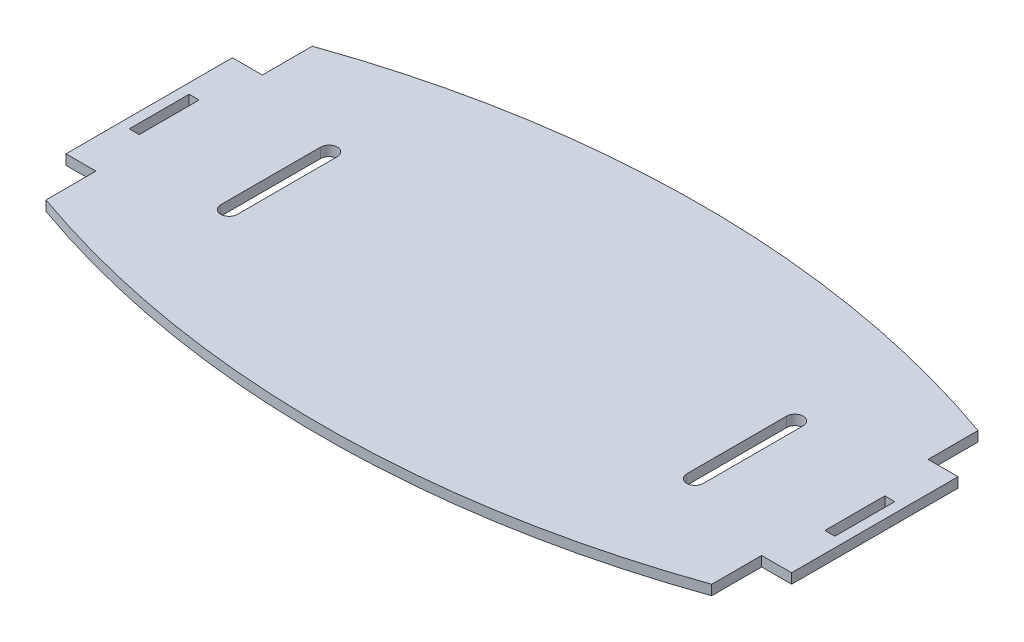
ISO-10303-21;
HEADER;
FILE_DESCRIPTION(('STEP AP214'),'2;1');
FILE_NAME('part.step','',(''),(''),'','','');
FILE_SCHEMA(('AUTOMOTIVE_DESIGN { 1 0 10303 214 1 1 1 1 }'));
ENDSEC;
DATA;
#1=APPLICATION_CONTEXT('core data for automotive mechanical design processes');
#2=APPLICATION_PROTOCOL_DEFINITION('international standard','automotive_design',2000,#1);
#3=PRODUCT_CONTEXT('',#1,'mechanical');
#4=PRODUCT('Part','Part','',(#3));
#5=PRODUCT_RELATED_PRODUCT_CATEGORY('part','',(#4));
#6=PRODUCT_DEFINITION_FORMATION('','',#4);
#7=PRODUCT_DEFINITION_CONTEXT('part definition',#1,'design');
#8=PRODUCT_DEFINITION('design','',#6,#7);
#9=PRODUCT_DEFINITION_SHAPE('','',#8);
#10=(LENGTH_UNIT() NAMED_UNIT(*) SI_UNIT(.MILLI.,.METRE.));
#11=(NAMED_UNIT(*) PLANE_ANGLE_UNIT() SI_UNIT($,.RADIAN.));
#12=(NAMED_UNIT(*) SI_UNIT($,.STERADIAN.) SOLID_ANGLE_UNIT());
#13=UNCERTAINTY_MEASURE_WITH_UNIT(LENGTH_MEASURE(1.E-05),#10,'distance_accuracy_value','');
#14=(GEOMETRIC_REPRESENTATION_CONTEXT(3) GLOBAL_UNCERTAINTY_ASSIGNED_CONTEXT((#13)) GLOBAL_UNIT_ASSIGNED_CONTEXT((#10,
#11,#12)) REPRESENTATION_CONTEXT('',''));
#15=CARTESIAN_POINT('',(0.,0.,0.));
#16=DIRECTION('',(0.,0.,1.));
#17=DIRECTION('',(1.,0.,0.));
#18=AXIS2_PLACEMENT_3D('',#15,#16,#17);
#19=CARTESIAN_POINT('',(0.,3.,-242.842712474619));
#20=DIRECTION('',(0.,1.,0.));
#21=DIRECTION('',(0.,0.,1.));
#22=AXIS2_PLACEMENT_3D('',#19,#20,#21);
#23=PLANE('',#22);
#24=CARTESIAN_POINT('',(0.,3.,-242.842712474619));
#25=DIRECTION('',(0.,1.,0.));
#26=DIRECTION('',(0.,0.,1.));
#27=AXIS2_PLACEMENT_3D('',#24,#25,#26);
#28=CIRCLE('',#27,300.);
#29=CARTESIAN_POINT('',(-100.,3.,40.));
#30=VERTEX_POINT('',#29);
#31=CARTESIAN_POINT('',(99.9999999999999,3.,40.));
#32=VERTEX_POINT('',#31);
#33=EDGE_CURVE('E346',#30,#32,#28,.T.);
#34=ORIENTED_EDGE('',*,*,#33,.T.);
#35=DIRECTION('',(0.,0.,-1.));
#36=VECTOR('',#35,1.);
#37=CARTESIAN_POINT('',(99.9999999999999,3.,40.));
#38=LINE('',#37,#36);
#39=CARTESIAN_POINT('',(100.,3.,25.));
#40=VERTEX_POINT('',#39);
#41=EDGE_CURVE('E349',#32,#40,#38,.T.);
#42=ORIENTED_EDGE('',*,*,#41,.T.);
#43=DIRECTION('',(1.,0.,0.));
#44=VECTOR('',#43,1.);
#45=CARTESIAN_POINT('',(100.,3.,25.));
#46=LINE('',#45,#44);
#47=CARTESIAN_POINT('',(109.,3.,25.));
#48=VERTEX_POINT('',#47);
#49=EDGE_CURVE('E352',#40,#48,#46,.T.);
#50=ORIENTED_EDGE('',*,*,#49,.T.);
#51=DIRECTION('',(0.,0.,-1.));
#52=VECTOR('',#51,1.);
#53=CARTESIAN_POINT('',(109.,3.,-25.));
#54=LINE('',#53,#52);
#55=CARTESIAN_POINT('',(109.,3.,-25.));
#56=VERTEX_POINT('',#55);
#57=EDGE_CURVE('E354',#48,#56,#54,.T.);
#58=ORIENTED_EDGE('',*,*,#57,.T.);
#59=DIRECTION('',(-1.,0.,0.));
#60=VECTOR('',#59,1.);
#61=CARTESIAN_POINT('',(100.,3.,-25.));
#62=LINE('',#61,#60);
#63=CARTESIAN_POINT('',(100.,3.,-25.));
#64=VERTEX_POINT('',#63);
#65=EDGE_CURVE('E356',#56,#64,#62,.T.);
#66=ORIENTED_EDGE('',*,*,#65,.T.);
#67=DIRECTION('',(0.,0.,-1.));
#68=VECTOR('',#67,1.);
#69=CARTESIAN_POINT('',(99.9999999999999,3.,-40.));
#70=LINE('',#69,#68);
#71=CARTESIAN_POINT('',(99.9999999999999,3.,-40.));
#72=VERTEX_POINT('',#71);
#73=EDGE_CURVE('E358',#64,#72,#70,.T.);
#74=ORIENTED_EDGE('',*,*,#73,.T.);
#75=CARTESIAN_POINT('',(0.,3.,242.842712474619));
#76=DIRECTION('',(0.,1.,0.));
#77=DIRECTION('',(0.,0.,-1.));
#78=AXIS2_PLACEMENT_3D('',#75,#76,#77);
#79=CIRCLE('',#78,300.);
#80=CARTESIAN_POINT('',(-100.,3.,-39.9999999999999));
#81=VERTEX_POINT('',#80);
#82=EDGE_CURVE('E360',#72,#81,#79,.T.);
#83=ORIENTED_EDGE('',*,*,#82,.T.);
#84=DIRECTION('',(0.,0.,1.));
#85=VECTOR('',#84,1.);
#86=CARTESIAN_POINT('',(-100.,3.,-40.));
#87=LINE('',#86,#85);
#88=CARTESIAN_POINT('',(-100.,3.,-25.));
#89=VERTEX_POINT('',#88);
#90=EDGE_CURVE('E362',#81,#89,#87,.T.);
#91=ORIENTED_EDGE('',*,*,#90,.T.);
#92=DIRECTION('',(-1.,0.,0.));
#93=VECTOR('',#92,1.);
#94=CARTESIAN_POINT('',(-100.,3.,-25.));
#95=LINE('',#94,#93);
#96=CARTESIAN_POINT('',(-109.,3.,-25.));
#97=VERTEX_POINT('',#96);
#98=EDGE_CURVE('E364',#89,#97,#95,.T.);
#99=ORIENTED_EDGE('',*,*,#98,.T.);
#100=DIRECTION('',(0.,0.,1.));
#101=VECTOR('',#100,1.);
#102=CARTESIAN_POINT('',(-109.,3.,-25.));
#103=LINE('',#102,#101);
#104=CARTESIAN_POINT('',(-109.,3.,25.));
#105=VERTEX_POINT('',#104);
#106=EDGE_CURVE('E366',#97,#105,#103,.T.);
#107=ORIENTED_EDGE('',*,*,#106,.T.);
#108=DIRECTION('',(1.,0.,0.));
#109=VECTOR('',#108,1.);
#110=CARTESIAN_POINT('',(-100.,3.,25.));
#111=LINE('',#110,#109);
#112=CARTESIAN_POINT('',(-100.,3.,25.));
#113=VERTEX_POINT('',#112);
#114=EDGE_CURVE('E368',#105,#113,#111,.T.);
#115=ORIENTED_EDGE('',*,*,#114,.T.);
#116=DIRECTION('',(0.,0.,1.));
#117=VECTOR('',#116,1.);
#118=CARTESIAN_POINT('',(-100.,3.,40.));
#119=LINE('',#118,#117);
#120=EDGE_CURVE('E370',#113,#30,#119,.T.);
#121=ORIENTED_EDGE('',*,*,#120,.T.);
#122=EDGE_LOOP('',(#34,#42,#50,#58,#66,#74,#83,#91,#99,#107,#115,#121));
#123=FACE_BOUND('',#122,.T.);
#124=DIRECTION('',(0.,0.,-1.));
#125=VECTOR('',#124,1.);
#126=CARTESIAN_POINT('',(106.,3.,-9.));
#127=LINE('',#126,#125);
#128=CARTESIAN_POINT('',(106.,3.,9.));
#129=VERTEX_POINT('',#128);
#130=CARTESIAN_POINT('',(106.,3.,-9.));
#131=VERTEX_POINT('',#130);
#132=EDGE_CURVE('E317',#129,#131,#127,.T.);
#133=ORIENTED_EDGE('',*,*,#132,.F.);
#134=DIRECTION('',(1.,0.,0.));
#135=VECTOR('',#134,1.);
#136=CARTESIAN_POINT('',(103.,3.,9.));
#137=LINE('',#136,#135);
#138=CARTESIAN_POINT('',(103.,3.,9.));
#139=VERTEX_POINT('',#138);
#140=EDGE_CURVE('E315',#139,#129,#137,.T.);
#141=ORIENTED_EDGE('',*,*,#140,.F.);
#142=DIRECTION('',(0.,0.,1.));
#143=VECTOR('',#142,1.);
#144=CARTESIAN_POINT('',(103.,3.,9.));
#145=LINE('',#144,#143);
#146=CARTESIAN_POINT('',(103.,3.,-9.00000000000001));
#147=VERTEX_POINT('',#146);
#148=EDGE_CURVE('E323',#147,#139,#145,.T.);
#149=ORIENTED_EDGE('',*,*,#148,.F.);
#150=DIRECTION('',(-1.,0.,0.));
#151=VECTOR('',#150,1.);
#152=CARTESIAN_POINT('',(103.,3.,-9.));
#153=LINE('',#152,#151);
#154=EDGE_CURVE('E320',#131,#147,#153,.T.);
#155=ORIENTED_EDGE('',*,*,#154,.F.);
#156=EDGE_LOOP('',(#133,#141,#149,#155));
#157=FACE_BOUND('',#156,.T.);
#158=DIRECTION('',(-1.,0.,0.));
#159=VECTOR('',#158,1.);
#160=CARTESIAN_POINT('',(-103.,3.,-9.));
#161=LINE('',#160,#159);
#162=CARTESIAN_POINT('',(-103.,3.,-9.));
#163=VERTEX_POINT('',#162);
#164=CARTESIAN_POINT('',(-106.,3.,-9.));
#165=VERTEX_POINT('',#164);
#166=EDGE_CURVE('E286',#163,#165,#161,.T.);
#167=ORIENTED_EDGE('',*,*,#166,.F.);
#168=DIRECTION('',(0.,0.,-1.));
#169=VECTOR('',#168,1.);
#170=CARTESIAN_POINT('',(-103.,3.,9.));
#171=LINE('',#170,#169);
#172=CARTESIAN_POINT('',(-103.,3.,9.));
#173=VERTEX_POINT('',#172);
#174=EDGE_CURVE('E284',#173,#163,#171,.T.);
#175=ORIENTED_EDGE('',*,*,#174,.F.);
#176=DIRECTION('',(1.,0.,0.));
#177=VECTOR('',#176,1.);
#178=CARTESIAN_POINT('',(-103.,3.,9.));
#179=LINE('',#178,#177);
#180=CARTESIAN_POINT('',(-106.,3.,8.99999999999998));
#181=VERTEX_POINT('',#180);
#182=EDGE_CURVE('E292',#181,#173,#179,.T.);
#183=ORIENTED_EDGE('',*,*,#182,.F.);
#184=DIRECTION('',(0.,0.,1.));
#185=VECTOR('',#184,1.);
#186=CARTESIAN_POINT('',(-106.,3.,-9.));
#187=LINE('',#186,#185);
#188=EDGE_CURVE('E289',#165,#181,#187,.T.);
#189=ORIENTED_EDGE('',*,*,#188,.F.);
#190=EDGE_LOOP('',(#167,#175,#183,#189));
#191=FACE_BOUND('',#190,.T.);
#192=DIRECTION('',(0.,0.,1.));
#193=VECTOR('',#192,1.);
#194=CARTESIAN_POINT('',(-72.5000000000001,3.,15.));
#195=LINE('',#194,#193);
#196=CARTESIAN_POINT('',(-72.5000000000001,3.,-15.));
#197=VERTEX_POINT('',#196);
#198=CARTESIAN_POINT('',(-72.5000000000001,3.,15.));
#199=VERTEX_POINT('',#198);
#200=EDGE_CURVE('E255',#197,#199,#195,.T.);
#201=ORIENTED_EDGE('',*,*,#200,.F.);
#202=CARTESIAN_POINT('',(-70.,3.,-15.));
#203=DIRECTION('',(0.,1.,0.));
#204=DIRECTION('',(0.,0.,-1.));
#205=AXIS2_PLACEMENT_3D('',#202,#203,#204);
#206=CIRCLE('',#205,2.5);
#207=CARTESIAN_POINT('',(-67.5000000000001,3.,-15.));
#208=VERTEX_POINT('',#207);
#209=EDGE_CURVE('E253',#208,#197,#206,.T.);
#210=ORIENTED_EDGE('',*,*,#209,.F.);
#211=DIRECTION('',(0.,0.,-1.));
#212=VECTOR('',#211,1.);
#213=CARTESIAN_POINT('',(-67.5000000000001,3.,-15.));
#214=LINE('',#213,#212);
#215=CARTESIAN_POINT('',(-67.5000000000001,3.,15.));
#216=VERTEX_POINT('',#215);
#217=EDGE_CURVE('E261',#216,#208,#214,.T.);
#218=ORIENTED_EDGE('',*,*,#217,.F.);
#219=CARTESIAN_POINT('',(-70.,3.,15.));
#220=DIRECTION('',(0.,1.,0.));
#221=DIRECTION('',(0.,0.,1.));
#222=AXIS2_PLACEMENT_3D('',#219,#220,#221);
#223=CIRCLE('',#222,2.5);
#224=EDGE_CURVE('E258',#199,#216,#223,.T.);
#225=ORIENTED_EDGE('',*,*,#224,.F.);
#226=EDGE_LOOP('',(#201,#210,#218,#225));
#227=FACE_BOUND('',#226,.T.);
#228=DIRECTION('',(0.,0.,-1.));
#229=VECTOR('',#228,1.);
#230=CARTESIAN_POINT('',(72.5000000000001,3.,15.));
#231=LINE('',#230,#229);
#232=CARTESIAN_POINT('',(72.5000000000001,3.,15.));
#233=VERTEX_POINT('',#232);
#234=CARTESIAN_POINT('',(72.5000000000001,3.,-15.));
#235=VERTEX_POINT('',#234);
#236=EDGE_CURVE('E225',#233,#235,#231,.T.);
#237=ORIENTED_EDGE('',*,*,#236,.F.);
#238=CARTESIAN_POINT('',(70.,3.,15.));
#239=DIRECTION('',(0.,1.,0.));
#240=DIRECTION('',(0.,0.,-1.));
#241=AXIS2_PLACEMENT_3D('',#238,#239,#240);
#242=CIRCLE('',#241,2.5);
#243=CARTESIAN_POINT('',(67.5000000000001,3.,15.));
#244=VERTEX_POINT('',#243);
#245=EDGE_CURVE('E217',#244,#233,#242,.T.);
#246=ORIENTED_EDGE('',*,*,#245,.F.);
#247=DIRECTION('',(0.,0.,1.));
#248=VECTOR('',#247,1.);
#249=CARTESIAN_POINT('',(67.5000000000001,3.,-15.));
#250=LINE('',#249,#248);
#251=CARTESIAN_POINT('',(67.5000000000001,3.,-15.));
#252=VERTEX_POINT('',#251);
#253=EDGE_CURVE('E239',#252,#244,#250,.T.);
#254=ORIENTED_EDGE('',*,*,#253,.F.);
#255=CARTESIAN_POINT('',(70.,3.,-15.));
#256=DIRECTION('',(0.,1.,0.));
#257=DIRECTION('',(0.,0.,1.));
#258=AXIS2_PLACEMENT_3D('',#255,#256,#257);
#259=CIRCLE('',#258,2.5);
#260=EDGE_CURVE('E237',#235,#252,#259,.T.);
#261=ORIENTED_EDGE('',*,*,#260,.F.);
#262=EDGE_LOOP('',(#237,#246,#254,#261));
#263=FACE_BOUND('',#262,.T.);
#264=ADVANCED_FACE('F32',(#123,#157,#191,#227,#263),#23,.T.);
#265=CARTESIAN_POINT('',(0.,0.,-242.842712474619));
#266=DIRECTION('',(0.,1.,0.));
#267=DIRECTION('',(0.,0.,1.));
#268=AXIS2_PLACEMENT_3D('',#265,#266,#267);
#269=PLANE('',#268);
#270=CARTESIAN_POINT('',(-70.,0.,-15.));
#271=DIRECTION('',(0.,1.,0.));
#272=DIRECTION('',(0.,0.,-1.));
#273=AXIS2_PLACEMENT_3D('',#270,#271,#272);
#274=CIRCLE('',#273,2.5);
#275=CARTESIAN_POINT('',(-67.5000000000001,0.,-15.));
#276=VERTEX_POINT('',#275);
#277=CARTESIAN_POINT('',(-72.5000000000001,0.,-15.));
#278=VERTEX_POINT('',#277);
#279=EDGE_CURVE('E233',#276,#278,#274,.T.);
#280=ORIENTED_EDGE('',*,*,#279,.T.);
#281=DIRECTION('',(0.,0.,1.));
#282=VECTOR('',#281,1.);
#283=CARTESIAN_POINT('',(-72.5000000000001,0.,15.));
#284=LINE('',#283,#282);
#285=CARTESIAN_POINT('',(-72.5000000000001,0.,15.));
#286=VERTEX_POINT('',#285);
#287=EDGE_CURVE('E266',#278,#286,#284,.T.);
#288=ORIENTED_EDGE('',*,*,#287,.T.);
#289=CARTESIAN_POINT('',(-70.,0.,15.));
#290=DIRECTION('',(0.,1.,0.));
#291=DIRECTION('',(0.,0.,1.));
#292=AXIS2_PLACEMENT_3D('',#289,#290,#291);
#293=CIRCLE('',#292,2.5);
#294=CARTESIAN_POINT('',(-67.5,0.,15.));
#295=VERTEX_POINT('',#294);
#296=EDGE_CURVE('E269',#286,#295,#293,.T.);
#297=ORIENTED_EDGE('',*,*,#296,.T.);
#298=DIRECTION('',(0.,0.,-1.));
#299=VECTOR('',#298,1.);
#300=CARTESIAN_POINT('',(-67.5000000000001,0.,-15.));
#301=LINE('',#300,#299);
#302=EDGE_CURVE('E256',#295,#276,#301,.T.);
#303=ORIENTED_EDGE('',*,*,#302,.T.);
#304=EDGE_LOOP('',(#280,#288,#297,#303));
#305=FACE_BOUND('',#304,.T.);
#306=DIRECTION('',(1.,0.,0.));
#307=VECTOR('',#306,1.);
#308=CARTESIAN_POINT('',(103.,0.,9.));
#309=LINE('',#308,#307);
#310=CARTESIAN_POINT('',(103.,0.,9.00000000000004));
#311=VERTEX_POINT('',#310);
#312=CARTESIAN_POINT('',(106.,0.,9.));
#313=VERTEX_POINT('',#312);
#314=EDGE_CURVE('E314',#311,#313,#309,.T.);
#315=ORIENTED_EDGE('',*,*,#314,.T.);
#316=DIRECTION('',(0.,0.,-1.));
#317=VECTOR('',#316,1.);
#318=CARTESIAN_POINT('',(106.,0.,-9.));
#319=LINE('',#318,#317);
#320=CARTESIAN_POINT('',(106.,0.,-9.));
#321=VERTEX_POINT('',#320);
#322=EDGE_CURVE('E328',#313,#321,#319,.T.);
#323=ORIENTED_EDGE('',*,*,#322,.T.);
#324=DIRECTION('',(-1.,0.,0.));
#325=VECTOR('',#324,1.);
#326=CARTESIAN_POINT('',(103.,0.,-9.));
#327=LINE('',#326,#325);
#328=CARTESIAN_POINT('',(103.,0.,-9.));
#329=VERTEX_POINT('',#328);
#330=EDGE_CURVE('E331',#321,#329,#327,.T.);
#331=ORIENTED_EDGE('',*,*,#330,.T.);
#332=DIRECTION('',(0.,0.,1.));
#333=VECTOR('',#332,1.);
#334=CARTESIAN_POINT('',(103.,0.,9.));
#335=LINE('',#334,#333);
#336=EDGE_CURVE('E318',#329,#311,#335,.T.);
#337=ORIENTED_EDGE('',*,*,#336,.T.);
#338=EDGE_LOOP('',(#315,#323,#331,#337));
#339=FACE_BOUND('',#338,.T.);
#340=CARTESIAN_POINT('',(0.,0.,-242.842712474619));
#341=DIRECTION('',(0.,1.,0.));
#342=DIRECTION('',(0.,0.,1.));
#343=AXIS2_PLACEMENT_3D('',#340,#341,#342);
#344=CIRCLE('',#343,300.);
#345=CARTESIAN_POINT('',(-100.,0.,40.));
#346=VERTEX_POINT('',#345);
#347=CARTESIAN_POINT('',(99.9999999999999,0.,40.));
#348=VERTEX_POINT('',#347);
#349=EDGE_CURVE('E345',#346,#348,#344,.T.);
#350=ORIENTED_EDGE('',*,*,#349,.F.);
#351=DIRECTION('',(0.,0.,1.));
#352=VECTOR('',#351,1.);
#353=CARTESIAN_POINT('',(-100.,0.,40.));
#354=LINE('',#353,#352);
#355=CARTESIAN_POINT('',(-100.,0.,25.));
#356=VERTEX_POINT('',#355);
#357=EDGE_CURVE('E350',#356,#346,#354,.T.);
#358=ORIENTED_EDGE('',*,*,#357,.F.);
#359=DIRECTION('',(1.,0.,0.));
#360=VECTOR('',#359,1.);
#361=CARTESIAN_POINT('',(-100.,0.,25.));
#362=LINE('',#361,#360);
#363=CARTESIAN_POINT('',(-109.,0.,25.));
#364=VERTEX_POINT('',#363);
#365=EDGE_CURVE('E393',#364,#356,#362,.T.);
#366=ORIENTED_EDGE('',*,*,#365,.F.);
#367=DIRECTION('',(0.,0.,1.));
#368=VECTOR('',#367,1.);
#369=CARTESIAN_POINT('',(-109.,0.,-25.));
#370=LINE('',#369,#368);
#371=CARTESIAN_POINT('',(-109.,0.,-25.));
#372=VERTEX_POINT('',#371);
#373=EDGE_CURVE('E391',#372,#364,#370,.T.);
#374=ORIENTED_EDGE('',*,*,#373,.F.);
#375=DIRECTION('',(-1.,0.,0.));
#376=VECTOR('',#375,1.);
#377=CARTESIAN_POINT('',(-100.,0.,-25.));
#378=LINE('',#377,#376);
#379=CARTESIAN_POINT('',(-100.,0.,-25.));
#380=VERTEX_POINT('',#379);
#381=EDGE_CURVE('E389',#380,#372,#378,.T.);
#382=ORIENTED_EDGE('',*,*,#381,.F.);
#383=DIRECTION('',(0.,0.,1.));
#384=VECTOR('',#383,1.);
#385=CARTESIAN_POINT('',(-100.,0.,-40.));
#386=LINE('',#385,#384);
#387=CARTESIAN_POINT('',(-100.,0.,-39.9999999999999));
#388=VERTEX_POINT('',#387);
#389=EDGE_CURVE('E387',#388,#380,#386,.T.);
#390=ORIENTED_EDGE('',*,*,#389,.F.);
#391=CARTESIAN_POINT('',(0.,0.,242.842712474619));
#392=DIRECTION('',(0.,1.,0.));
#393=DIRECTION('',(0.,0.,-1.));
#394=AXIS2_PLACEMENT_3D('',#391,#392,#393);
#395=CIRCLE('',#394,300.);
#396=CARTESIAN_POINT('',(99.9999999999999,0.,-40.));
#397=VERTEX_POINT('',#396);
#398=EDGE_CURVE('E385',#397,#388,#395,.T.);
#399=ORIENTED_EDGE('',*,*,#398,.F.);
#400=DIRECTION('',(0.,0.,-1.));
#401=VECTOR('',#400,1.);
#402=CARTESIAN_POINT('',(99.9999999999999,0.,-40.));
#403=LINE('',#402,#401);
#404=CARTESIAN_POINT('',(100.,0.,-25.));
#405=VERTEX_POINT('',#404);
#406=EDGE_CURVE('E383',#405,#397,#403,.T.);
#407=ORIENTED_EDGE('',*,*,#406,.F.);
#408=DIRECTION('',(-1.,0.,0.));
#409=VECTOR('',#408,1.);
#410=CARTESIAN_POINT('',(100.,0.,-25.));
#411=LINE('',#410,#409);
#412=CARTESIAN_POINT('',(109.,0.,-25.));
#413=VERTEX_POINT('',#412);
#414=EDGE_CURVE('E381',#413,#405,#411,.T.);
#415=ORIENTED_EDGE('',*,*,#414,.F.);
#416=DIRECTION('',(0.,0.,-1.));
#417=VECTOR('',#416,1.);
#418=CARTESIAN_POINT('',(109.,0.,-25.));
#419=LINE('',#418,#417);
#420=CARTESIAN_POINT('',(109.,0.,25.));
#421=VERTEX_POINT('',#420);
#422=EDGE_CURVE('E379',#421,#413,#419,.T.);
#423=ORIENTED_EDGE('',*,*,#422,.F.);
#424=DIRECTION('',(1.,0.,0.));
#425=VECTOR('',#424,1.);
#426=CARTESIAN_POINT('',(100.,0.,25.));
#427=LINE('',#426,#425);
#428=CARTESIAN_POINT('',(100.,0.,25.));
#429=VERTEX_POINT('',#428);
#430=EDGE_CURVE('E377',#429,#421,#427,.T.);
#431=ORIENTED_EDGE('',*,*,#430,.F.);
#432=DIRECTION('',(0.,0.,-1.));
#433=VECTOR('',#432,1.);
#434=CARTESIAN_POINT('',(99.9999999999999,0.,40.));
#435=LINE('',#434,#433);
#436=EDGE_CURVE('E375',#348,#429,#435,.T.);
#437=ORIENTED_EDGE('',*,*,#436,.F.);
#438=EDGE_LOOP('',(#350,#358,#366,#374,#382,#390,#399,#407,#415,#423,#431,#437));
#439=FACE_BOUND('',#438,.T.);
#440=DIRECTION('',(0.,0.,-1.));
#441=VECTOR('',#440,1.);
#442=CARTESIAN_POINT('',(-103.,0.,9.));
#443=LINE('',#442,#441);
#444=CARTESIAN_POINT('',(-103.,0.,8.99999999999998));
#445=VERTEX_POINT('',#444);
#446=CARTESIAN_POINT('',(-103.,0.,-9.));
#447=VERTEX_POINT('',#446);
#448=EDGE_CURVE('E283',#445,#447,#443,.T.);
#449=ORIENTED_EDGE('',*,*,#448,.T.);
#450=DIRECTION('',(-1.,0.,0.));
#451=VECTOR('',#450,1.);
#452=CARTESIAN_POINT('',(-103.,0.,-9.));
#453=LINE('',#452,#451);
#454=CARTESIAN_POINT('',(-106.,0.,-9.));
#455=VERTEX_POINT('',#454);
#456=EDGE_CURVE('E297',#447,#455,#453,.T.);
#457=ORIENTED_EDGE('',*,*,#456,.T.);
#458=DIRECTION('',(0.,0.,1.));
#459=VECTOR('',#458,1.);
#460=CARTESIAN_POINT('',(-106.,0.,-9.));
#461=LINE('',#460,#459);
#462=CARTESIAN_POINT('',(-106.,0.,9.));
#463=VERTEX_POINT('',#462);
#464=EDGE_CURVE('E300',#455,#463,#461,.T.);
#465=ORIENTED_EDGE('',*,*,#464,.T.);
#466=DIRECTION('',(1.,0.,0.));
#467=VECTOR('',#466,1.);
#468=CARTESIAN_POINT('',(-103.,0.,9.));
#469=LINE('',#468,#467);
#470=EDGE_CURVE('E287',#463,#445,#469,.T.);
#471=ORIENTED_EDGE('',*,*,#470,.T.);
#472=EDGE_LOOP('',(#449,#457,#465,#471));
#473=FACE_BOUND('',#472,.T.);
#474=CARTESIAN_POINT('',(70.,0.,15.));
#475=DIRECTION('',(0.,1.,0.));
#476=DIRECTION('',(0.,0.,-1.));
#477=AXIS2_PLACEMENT_3D('',#474,#475,#476);
#478=CIRCLE('',#477,2.5);
#479=CARTESIAN_POINT('',(67.5000000000001,0.,15.));
#480=VERTEX_POINT('',#479);
#481=CARTESIAN_POINT('',(72.5000000000001,0.,15.));
#482=VERTEX_POINT('',#481);
#483=EDGE_CURVE('E55',#480,#482,#478,.T.);
#484=ORIENTED_EDGE('',*,*,#483,.T.);
#485=DIRECTION('',(0.,0.,-1.));
#486=VECTOR('',#485,1.);
#487=CARTESIAN_POINT('',(72.5000000000001,0.,15.));
#488=LINE('',#487,#486);
#489=CARTESIAN_POINT('',(72.5000000000001,0.,-15.));
#490=VERTEX_POINT('',#489);
#491=EDGE_CURVE('E232',#482,#490,#488,.T.);
#492=ORIENTED_EDGE('',*,*,#491,.T.);
#493=CARTESIAN_POINT('',(70.,0.,-15.));
#494=DIRECTION('',(0.,1.,0.));
#495=DIRECTION('',(0.,0.,1.));
#496=AXIS2_PLACEMENT_3D('',#493,#494,#495);
#497=CIRCLE('',#496,2.5);
#498=CARTESIAN_POINT('',(67.4999999999999,0.,-15.));
#499=VERTEX_POINT('',#498);
#500=EDGE_CURVE('E245',#490,#499,#497,.T.);
#501=ORIENTED_EDGE('',*,*,#500,.T.);
#502=DIRECTION('',(0.,0.,1.));
#503=VECTOR('',#502,1.);
#504=CARTESIAN_POINT('',(67.5000000000001,0.,-15.));
#505=LINE('',#504,#503);
#506=EDGE_CURVE('E226',#499,#480,#505,.T.);
#507=ORIENTED_EDGE('',*,*,#506,.T.);
#508=EDGE_LOOP('',(#484,#492,#501,#507));
#509=FACE_BOUND('',#508,.T.);
#510=ADVANCED_FACE('F435',(#305,#339,#439,#473,#509),#269,.F.);
#511=CARTESIAN_POINT('',(0.,3.,-242.842712474619));
#512=DIRECTION('',(0.,-1.,0.));
#513=DIRECTION('',(0.,0.,-1.));
#514=AXIS2_PLACEMENT_3D('',#511,#512,#513);
#515=CYLINDRICAL_SURFACE('',#514,300.);
#516=ORIENTED_EDGE('',*,*,#349,.T.);
#517=DIRECTION('',(0.,-1.,0.));
#518=VECTOR('',#517,1.);
#519=CARTESIAN_POINT('',(99.9999999999999,3.,40.));
#520=LINE('',#519,#518);
#521=EDGE_CURVE('E11',#32,#348,#520,.T.);
#522=ORIENTED_EDGE('',*,*,#521,.F.);
#523=ORIENTED_EDGE('',*,*,#33,.F.);
#524=DIRECTION('',(0.,-1.,0.));
#525=VECTOR('',#524,1.);
#526=CARTESIAN_POINT('',(-100.,3.,40.));
#527=LINE('',#526,#525);
#528=EDGE_CURVE('E372',#30,#346,#527,.T.);
#529=ORIENTED_EDGE('',*,*,#528,.T.);
#530=EDGE_LOOP('',(#516,#522,#523,#529));
#531=FACE_BOUND('',#530,.T.);
#532=ADVANCED_FACE('F34',(#531),#515,.T.);
#533=CARTESIAN_POINT('',(99.9999999999999,3.,40.));
#534=DIRECTION('',(-1.,0.,0.));
#535=DIRECTION('',(0.,0.,1.));
#536=AXIS2_PLACEMENT_3D('',#533,#534,#535);
#537=PLANE('',#536);
#538=ORIENTED_EDGE('',*,*,#436,.T.);
#539=DIRECTION('',(0.,-1.,0.));
#540=VECTOR('',#539,1.);
#541=CARTESIAN_POINT('',(100.,3.,25.));
#542=LINE('',#541,#540);
#543=EDGE_CURVE('E40',#40,#429,#542,.T.);
#544=ORIENTED_EDGE('',*,*,#543,.F.);
#545=ORIENTED_EDGE('',*,*,#41,.F.);
#546=ORIENTED_EDGE('',*,*,#521,.T.);
#547=EDGE_LOOP('',(#538,#544,#545,#546));
#548=FACE_BOUND('',#547,.T.);
#549=ADVANCED_FACE('F453',(#548),#537,.F.);
#550=CARTESIAN_POINT('',(100.,3.,25.));
#551=DIRECTION('',(0.,0.,-1.));
#552=DIRECTION('',(-1.,0.,0.));
#553=AXIS2_PLACEMENT_3D('',#550,#551,#552);
#554=PLANE('',#553);
#555=ORIENTED_EDGE('',*,*,#430,.T.);
#556=DIRECTION('',(0.,-1.,0.));
#557=VECTOR('',#556,1.);
#558=CARTESIAN_POINT('',(109.,3.,25.));
#559=LINE('',#558,#557);
#560=EDGE_CURVE('E422',#48,#421,#559,.T.);
#561=ORIENTED_EDGE('',*,*,#560,.F.);
#562=ORIENTED_EDGE('',*,*,#49,.F.);
#563=ORIENTED_EDGE('',*,*,#543,.T.);
#564=EDGE_LOOP('',(#555,#561,#562,#563));
#565=FACE_BOUND('',#564,.T.);
#566=ADVANCED_FACE('F429',(#565),#554,.F.);
#567=CARTESIAN_POINT('',(109.,3.,-25.));
#568=DIRECTION('',(-1.,0.,0.));
#569=DIRECTION('',(0.,0.,1.));
#570=AXIS2_PLACEMENT_3D('',#567,#568,#569);
#571=PLANE('',#570);
#572=ORIENTED_EDGE('',*,*,#422,.T.);
#573=DIRECTION('',(0.,-1.,0.));
#574=VECTOR('',#573,1.);
#575=CARTESIAN_POINT('',(109.,3.,-25.));
#576=LINE('',#575,#574);
#577=EDGE_CURVE('E419',#56,#413,#576,.T.);
#578=ORIENTED_EDGE('',*,*,#577,.F.);
#579=ORIENTED_EDGE('',*,*,#57,.F.);
#580=ORIENTED_EDGE('',*,*,#560,.T.);
#581=EDGE_LOOP('',(#572,#578,#579,#580));
#582=FACE_BOUND('',#581,.T.);
#583=ADVANCED_FACE('F441',(#582),#571,.F.);
#584=CARTESIAN_POINT('',(100.,3.,-25.));
#585=DIRECTION('',(0.,0.,1.));
#586=DIRECTION('',(1.,0.,0.));
#587=AXIS2_PLACEMENT_3D('',#584,#585,#586);
#588=PLANE('',#587);
#589=ORIENTED_EDGE('',*,*,#414,.T.);
#590=DIRECTION('',(0.,-1.,0.));
#591=VECTOR('',#590,1.);
#592=CARTESIAN_POINT('',(100.,3.,-25.));
#593=LINE('',#592,#591);
#594=EDGE_CURVE('E416',#64,#405,#593,.T.);
#595=ORIENTED_EDGE('',*,*,#594,.F.);
#596=ORIENTED_EDGE('',*,*,#65,.F.);
#597=ORIENTED_EDGE('',*,*,#577,.T.);
#598=EDGE_LOOP('',(#589,#595,#596,#597));
#599=FACE_BOUND('',#598,.T.);
#600=ADVANCED_FACE('F445',(#599),#588,.F.);
#601=CARTESIAN_POINT('',(99.9999999999999,3.,-40.));
#602=DIRECTION('',(-1.,0.,0.));
#603=DIRECTION('',(0.,0.,1.));
#604=AXIS2_PLACEMENT_3D('',#601,#602,#603);
#605=PLANE('',#604);
#606=ORIENTED_EDGE('',*,*,#406,.T.);
#607=DIRECTION('',(0.,-1.,0.));
#608=VECTOR('',#607,1.);
#609=CARTESIAN_POINT('',(99.9999999999999,3.,-40.));
#610=LINE('',#609,#608);
#611=EDGE_CURVE('E413',#72,#397,#610,.T.);
#612=ORIENTED_EDGE('',*,*,#611,.F.);
#613=ORIENTED_EDGE('',*,*,#73,.F.);
#614=ORIENTED_EDGE('',*,*,#594,.T.);
#615=EDGE_LOOP('',(#606,#612,#613,#614));
#616=FACE_BOUND('',#615,.T.);
#617=ADVANCED_FACE('F486',(#616),#605,.F.);
#618=CARTESIAN_POINT('',(0.,3.,242.842712474619));
#619=DIRECTION('',(0.,-1.,0.));
#620=DIRECTION('',(0.,0.,-1.));
#621=AXIS2_PLACEMENT_3D('',#618,#619,#620);
#622=CYLINDRICAL_SURFACE('',#621,300.);
#623=ORIENTED_EDGE('',*,*,#398,.T.);
#624=DIRECTION('',(0.,-1.,0.));
#625=VECTOR('',#624,1.);
#626=CARTESIAN_POINT('',(-100.,3.,-39.9999999999999));
#627=LINE('',#626,#625);
#628=EDGE_CURVE('E410',#81,#388,#627,.T.);
#629=ORIENTED_EDGE('',*,*,#628,.F.);
#630=ORIENTED_EDGE('',*,*,#82,.F.);
#631=ORIENTED_EDGE('',*,*,#611,.T.);
#632=EDGE_LOOP('',(#623,#629,#630,#631));
#633=FACE_BOUND('',#632,.T.);
#634=ADVANCED_FACE('F484',(#633),#622,.T.);
#635=CARTESIAN_POINT('',(-100.,3.,-40.));
#636=DIRECTION('',(1.,0.,0.));
#637=DIRECTION('',(0.,0.,-1.));
#638=AXIS2_PLACEMENT_3D('',#635,#636,#637);
#639=PLANE('',#638);
#640=ORIENTED_EDGE('',*,*,#389,.T.);
#641=DIRECTION('',(0.,-1.,0.));
#642=VECTOR('',#641,1.);
#643=CARTESIAN_POINT('',(-100.,3.,-25.));
#644=LINE('',#643,#642);
#645=EDGE_CURVE('E407',#89,#380,#644,.T.);
#646=ORIENTED_EDGE('',*,*,#645,.F.);
#647=ORIENTED_EDGE('',*,*,#90,.F.);
#648=ORIENTED_EDGE('',*,*,#628,.T.);
#649=EDGE_LOOP('',(#640,#646,#647,#648));
#650=FACE_BOUND('',#649,.T.);
#651=ADVANCED_FACE('F480',(#650),#639,.F.);
#652=CARTESIAN_POINT('',(-100.,3.,-25.));
#653=DIRECTION('',(0.,0.,1.));
#654=DIRECTION('',(1.,0.,0.));
#655=AXIS2_PLACEMENT_3D('',#652,#653,#654);
#656=PLANE('',#655);
#657=ORIENTED_EDGE('',*,*,#381,.T.);
#658=DIRECTION('',(0.,-1.,0.));
#659=VECTOR('',#658,1.);
#660=CARTESIAN_POINT('',(-109.,3.,-25.));
#661=LINE('',#660,#659);
#662=EDGE_CURVE('E404',#97,#372,#661,.T.);
#663=ORIENTED_EDGE('',*,*,#662,.F.);
#664=ORIENTED_EDGE('',*,*,#98,.F.);
#665=ORIENTED_EDGE('',*,*,#645,.T.);
#666=EDGE_LOOP('',(#657,#663,#664,#665));
#667=FACE_BOUND('',#666,.T.);
#668=ADVANCED_FACE('F475',(#667),#656,.F.);
#669=CARTESIAN_POINT('',(-109.,3.,-25.));
#670=DIRECTION('',(1.,0.,0.));
#671=DIRECTION('',(0.,0.,-1.));
#672=AXIS2_PLACEMENT_3D('',#669,#670,#671);
#673=PLANE('',#672);
#674=ORIENTED_EDGE('',*,*,#373,.T.);
#675=DIRECTION('',(0.,-1.,0.));
#676=VECTOR('',#675,1.);
#677=CARTESIAN_POINT('',(-109.,3.,25.));
#678=LINE('',#677,#676);
#679=EDGE_CURVE('E401',#105,#364,#678,.T.);
#680=ORIENTED_EDGE('',*,*,#679,.F.);
#681=ORIENTED_EDGE('',*,*,#106,.F.);
#682=ORIENTED_EDGE('',*,*,#662,.T.);
#683=EDGE_LOOP('',(#674,#680,#681,#682));
#684=FACE_BOUND('',#683,.T.);
#685=ADVANCED_FACE('F469',(#684),#673,.F.);
#686=CARTESIAN_POINT('',(-100.,3.,25.));
#687=DIRECTION('',(0.,0.,-1.));
#688=DIRECTION('',(-1.,0.,0.));
#689=AXIS2_PLACEMENT_3D('',#686,#687,#688);
#690=PLANE('',#689);
#691=ORIENTED_EDGE('',*,*,#365,.T.);
#692=DIRECTION('',(0.,-1.,0.));
#693=VECTOR('',#692,1.);
#694=CARTESIAN_POINT('',(-100.,3.,25.));
#695=LINE('',#694,#693);
#696=EDGE_CURVE('E398',#113,#356,#695,.T.);
#697=ORIENTED_EDGE('',*,*,#696,.F.);
#698=ORIENTED_EDGE('',*,*,#114,.F.);
#699=ORIENTED_EDGE('',*,*,#679,.T.);
#700=EDGE_LOOP('',(#691,#697,#698,#699));
#701=FACE_BOUND('',#700,.T.);
#702=ADVANCED_FACE('F465',(#701),#690,.F.);
#703=CARTESIAN_POINT('',(-100.,3.,40.));
#704=DIRECTION('',(1.,0.,0.));
#705=DIRECTION('',(0.,0.,-1.));
#706=AXIS2_PLACEMENT_3D('',#703,#704,#705);
#707=PLANE('',#706);
#708=ORIENTED_EDGE('',*,*,#357,.T.);
#709=ORIENTED_EDGE('',*,*,#528,.F.);
#710=ORIENTED_EDGE('',*,*,#120,.F.);
#711=ORIENTED_EDGE('',*,*,#696,.T.);
#712=EDGE_LOOP('',(#708,#709,#710,#711));
#713=FACE_BOUND('',#712,.T.);
#714=ADVANCED_FACE('F460',(#713),#707,.F.);
#715=CARTESIAN_POINT('',(103.,3.,9.));
#716=DIRECTION('',(0.,0.,-1.));
#717=DIRECTION('',(-1.,0.,0.));
#718=AXIS2_PLACEMENT_3D('',#715,#716,#717);
#719=PLANE('',#718);
#720=ORIENTED_EDGE('',*,*,#314,.F.);
#721=DIRECTION('',(0.,-1.,0.));
#722=VECTOR('',#721,1.);
#723=CARTESIAN_POINT('',(103.,3.,9.));
#724=LINE('',#723,#722);
#725=EDGE_CURVE('E325',#139,#311,#724,.T.);
#726=ORIENTED_EDGE('',*,*,#725,.F.);
#727=ORIENTED_EDGE('',*,*,#140,.T.);
#728=DIRECTION('',(0.,-1.,0.));
#729=VECTOR('',#728,1.);
#730=CARTESIAN_POINT('',(106.,3.,9.));
#731=LINE('',#730,#729);
#732=EDGE_CURVE('E342',#129,#313,#731,.T.);
#733=ORIENTED_EDGE('',*,*,#732,.T.);
#734=EDGE_LOOP('',(#720,#726,#727,#733));
#735=FACE_BOUND('',#734,.T.);
#736=ADVANCED_FACE('F503',(#735),#719,.T.);
#737=CARTESIAN_POINT('',(106.,3.,-9.));
#738=DIRECTION('',(-1.,0.,0.));
#739=DIRECTION('',(0.,0.,1.));
#740=AXIS2_PLACEMENT_3D('',#737,#738,#739);
#741=PLANE('',#740);
#742=ORIENTED_EDGE('',*,*,#322,.F.);
#743=ORIENTED_EDGE('',*,*,#732,.F.);
#744=ORIENTED_EDGE('',*,*,#132,.T.);
#745=DIRECTION('',(0.,-1.,0.));
#746=VECTOR('',#745,1.);
#747=CARTESIAN_POINT('',(106.,3.,-9.));
#748=LINE('',#747,#746);
#749=EDGE_CURVE('E340',#131,#321,#748,.T.);
#750=ORIENTED_EDGE('',*,*,#749,.T.);
#751=EDGE_LOOP('',(#742,#743,#744,#750));
#752=FACE_BOUND('',#751,.T.);
#753=ADVANCED_FACE('F541',(#752),#741,.T.);
#754=CARTESIAN_POINT('',(103.,3.,-9.));
#755=DIRECTION('',(0.,0.,1.));
#756=DIRECTION('',(1.,0.,0.));
#757=AXIS2_PLACEMENT_3D('',#754,#755,#756);
#758=PLANE('',#757);
#759=ORIENTED_EDGE('',*,*,#330,.F.);
#760=ORIENTED_EDGE('',*,*,#749,.F.);
#761=ORIENTED_EDGE('',*,*,#154,.T.);
#762=DIRECTION('',(0.,-1.,0.));
#763=VECTOR('',#762,1.);
#764=CARTESIAN_POINT('',(103.,3.,-9.));
#765=LINE('',#764,#763);
#766=EDGE_CURVE('E338',#147,#329,#765,.T.);
#767=ORIENTED_EDGE('',*,*,#766,.T.);
#768=EDGE_LOOP('',(#759,#760,#761,#767));
#769=FACE_BOUND('',#768,.T.);
#770=ADVANCED_FACE('F548',(#769),#758,.T.);
#771=CARTESIAN_POINT('',(103.,3.,9.));
#772=DIRECTION('',(1.,0.,0.));
#773=DIRECTION('',(0.,0.,-1.));
#774=AXIS2_PLACEMENT_3D('',#771,#772,#773);
#775=PLANE('',#774);
#776=ORIENTED_EDGE('',*,*,#336,.F.);
#777=ORIENTED_EDGE('',*,*,#766,.F.);
#778=ORIENTED_EDGE('',*,*,#148,.T.);
#779=ORIENTED_EDGE('',*,*,#725,.T.);
#780=EDGE_LOOP('',(#776,#777,#778,#779));
#781=FACE_BOUND('',#780,.T.);
#782=ADVANCED_FACE('F555',(#781),#775,.T.);
#783=CARTESIAN_POINT('',(-103.,3.,9.));
#784=DIRECTION('',(-1.,0.,0.));
#785=DIRECTION('',(0.,0.,1.));
#786=AXIS2_PLACEMENT_3D('',#783,#784,#785);
#787=PLANE('',#786);
#788=ORIENTED_EDGE('',*,*,#448,.F.);
#789=DIRECTION('',(0.,-1.,0.));
#790=VECTOR('',#789,1.);
#791=CARTESIAN_POINT('',(-103.,3.,9.));
#792=LINE('',#791,#790);
#793=EDGE_CURVE('E294',#173,#445,#792,.T.);
#794=ORIENTED_EDGE('',*,*,#793,.F.);
#795=ORIENTED_EDGE('',*,*,#174,.T.);
#796=DIRECTION('',(0.,-1.,0.));
#797=VECTOR('',#796,1.);
#798=CARTESIAN_POINT('',(-103.,3.,-9.));
#799=LINE('',#798,#797);
#800=EDGE_CURVE('E311',#163,#447,#799,.T.);
#801=ORIENTED_EDGE('',*,*,#800,.T.);
#802=EDGE_LOOP('',(#788,#794,#795,#801));
#803=FACE_BOUND('',#802,.T.);
#804=ADVANCED_FACE('F563',(#803),#787,.T.);
#805=CARTESIAN_POINT('',(-103.,3.,-9.));
#806=DIRECTION('',(0.,0.,1.));
#807=DIRECTION('',(1.,0.,0.));
#808=AXIS2_PLACEMENT_3D('',#805,#806,#807);
#809=PLANE('',#808);
#810=ORIENTED_EDGE('',*,*,#456,.F.);
#811=ORIENTED_EDGE('',*,*,#800,.F.);
#812=ORIENTED_EDGE('',*,*,#166,.T.);
#813=DIRECTION('',(0.,-1.,0.));
#814=VECTOR('',#813,1.);
#815=CARTESIAN_POINT('',(-106.,3.,-9.));
#816=LINE('',#815,#814);
#817=EDGE_CURVE('E309',#165,#455,#816,.T.);
#818=ORIENTED_EDGE('',*,*,#817,.T.);
#819=EDGE_LOOP('',(#810,#811,#812,#818));
#820=FACE_BOUND('',#819,.T.);
#821=ADVANCED_FACE('F571',(#820),#809,.T.);
#822=CARTESIAN_POINT('',(-106.,3.,-9.));
#823=DIRECTION('',(1.,0.,0.));
#824=DIRECTION('',(0.,0.,-1.));
#825=AXIS2_PLACEMENT_3D('',#822,#823,#824);
#826=PLANE('',#825);
#827=ORIENTED_EDGE('',*,*,#464,.F.);
#828=ORIENTED_EDGE('',*,*,#817,.F.);
#829=ORIENTED_EDGE('',*,*,#188,.T.);
#830=DIRECTION('',(0.,-1.,0.));
#831=VECTOR('',#830,1.);
#832=CARTESIAN_POINT('',(-106.,3.,9.));
#833=LINE('',#832,#831);
#834=EDGE_CURVE('E307',#181,#463,#833,.T.);
#835=ORIENTED_EDGE('',*,*,#834,.T.);
#836=EDGE_LOOP('',(#827,#828,#829,#835));
#837=FACE_BOUND('',#836,.T.);
#838=ADVANCED_FACE('F579',(#837),#826,.T.);
#839=CARTESIAN_POINT('',(-103.,3.,9.));
#840=DIRECTION('',(0.,0.,-1.));
#841=DIRECTION('',(-1.,0.,0.));
#842=AXIS2_PLACEMENT_3D('',#839,#840,#841);
#843=PLANE('',#842);
#844=ORIENTED_EDGE('',*,*,#470,.F.);
#845=ORIENTED_EDGE('',*,*,#834,.F.);
#846=ORIENTED_EDGE('',*,*,#182,.T.);
#847=ORIENTED_EDGE('',*,*,#793,.T.);
#848=EDGE_LOOP('',(#844,#845,#846,#847));
#849=FACE_BOUND('',#848,.T.);
#850=ADVANCED_FACE('F587',(#849),#843,.T.);
#851=CARTESIAN_POINT('',(-70.,3.,-15.));
#852=DIRECTION('',(0.,-1.,0.));
#853=DIRECTION('',(0.,0.,-1.));
#854=AXIS2_PLACEMENT_3D('',#851,#852,#853);
#855=CYLINDRICAL_SURFACE('',#854,2.5);
#856=ORIENTED_EDGE('',*,*,#279,.F.);
#857=DIRECTION('',(0.,-1.,0.));
#858=VECTOR('',#857,1.);
#859=CARTESIAN_POINT('',(-67.5000000000001,3.,-15.));
#860=LINE('',#859,#858);
#861=EDGE_CURVE('E263',#208,#276,#860,.T.);
#862=ORIENTED_EDGE('',*,*,#861,.F.);
#863=ORIENTED_EDGE('',*,*,#209,.T.);
#864=DIRECTION('',(0.,-1.,0.));
#865=VECTOR('',#864,1.);
#866=CARTESIAN_POINT('',(-72.5000000000001,3.,-15.));
#867=LINE('',#866,#865);
#868=EDGE_CURVE('E280',#197,#278,#867,.T.);
#869=ORIENTED_EDGE('',*,*,#868,.T.);
#870=EDGE_LOOP('',(#856,#862,#863,#869));
#871=FACE_BOUND('',#870,.T.);
#872=ADVANCED_FACE('F595',(#871),#855,.F.);
#873=CARTESIAN_POINT('',(-72.5000000000001,3.,15.));
#874=DIRECTION('',(1.,0.,0.));
#875=DIRECTION('',(0.,0.,-1.));
#876=AXIS2_PLACEMENT_3D('',#873,#874,#875);
#877=PLANE('',#876);
#878=ORIENTED_EDGE('',*,*,#287,.F.);
#879=ORIENTED_EDGE('',*,*,#868,.F.);
#880=ORIENTED_EDGE('',*,*,#200,.T.);
#881=DIRECTION('',(0.,-1.,0.));
#882=VECTOR('',#881,1.);
#883=CARTESIAN_POINT('',(-72.5000000000001,3.,15.));
#884=LINE('',#883,#882);
#885=EDGE_CURVE('E278',#199,#286,#884,.T.);
#886=ORIENTED_EDGE('',*,*,#885,.T.);
#887=EDGE_LOOP('',(#878,#879,#880,#886));
#888=FACE_BOUND('',#887,.T.);
#889=ADVANCED_FACE('F603',(#888),#877,.T.);
#890=CARTESIAN_POINT('',(-70.,3.,15.));
#891=DIRECTION('',(0.,-1.,0.));
#892=DIRECTION('',(0.,0.,-1.));
#893=AXIS2_PLACEMENT_3D('',#890,#891,#892);
#894=CYLINDRICAL_SURFACE('',#893,2.5);
#895=ORIENTED_EDGE('',*,*,#296,.F.);
#896=ORIENTED_EDGE('',*,*,#885,.F.);
#897=ORIENTED_EDGE('',*,*,#224,.T.);
#898=DIRECTION('',(0.,-1.,0.));
#899=VECTOR('',#898,1.);
#900=CARTESIAN_POINT('',(-67.5,3.,15.));
#901=LINE('',#900,#899);
#902=EDGE_CURVE('E276',#216,#295,#901,.T.);
#903=ORIENTED_EDGE('',*,*,#902,.T.);
#904=EDGE_LOOP('',(#895,#896,#897,#903));
#905=FACE_BOUND('',#904,.T.);
#906=ADVANCED_FACE('F611',(#905),#894,.F.);
#907=CARTESIAN_POINT('',(-67.5000000000001,3.,-15.));
#908=DIRECTION('',(-1.,0.,0.));
#909=DIRECTION('',(0.,0.,1.));
#910=AXIS2_PLACEMENT_3D('',#907,#908,#909);
#911=PLANE('',#910);
#912=ORIENTED_EDGE('',*,*,#302,.F.);
#913=ORIENTED_EDGE('',*,*,#902,.F.);
#914=ORIENTED_EDGE('',*,*,#217,.T.);
#915=ORIENTED_EDGE('',*,*,#861,.T.);
#916=EDGE_LOOP('',(#912,#913,#914,#915));
#917=FACE_BOUND('',#916,.T.);
#918=ADVANCED_FACE('F619',(#917),#911,.T.);
#919=CARTESIAN_POINT('',(70.,3.,15.));
#920=DIRECTION('',(0.,-1.,0.));
#921=DIRECTION('',(0.,0.,-1.));
#922=AXIS2_PLACEMENT_3D('',#919,#920,#921);
#923=CYLINDRICAL_SURFACE('',#922,2.5);
#924=ORIENTED_EDGE('',*,*,#483,.F.);
#925=DIRECTION('',(0.,-1.,0.));
#926=VECTOR('',#925,1.);
#927=CARTESIAN_POINT('',(67.5000000000001,3.,15.));
#928=LINE('',#927,#926);
#929=EDGE_CURVE('E221',#244,#480,#928,.T.);
#930=ORIENTED_EDGE('',*,*,#929,.F.);
#931=ORIENTED_EDGE('',*,*,#245,.T.);
#932=DIRECTION('',(0.,-1.,0.));
#933=VECTOR('',#932,1.);
#934=CARTESIAN_POINT('',(72.5000000000001,3.,15.));
#935=LINE('',#934,#933);
#936=EDGE_CURVE('E220',#233,#482,#935,.T.);
#937=ORIENTED_EDGE('',*,*,#936,.T.);
#938=EDGE_LOOP('',(#924,#930,#931,#937));
#939=FACE_BOUND('',#938,.T.);
#940=ADVANCED_FACE('F219',(#939),#923,.F.);
#941=CARTESIAN_POINT('',(72.5000000000001,3.,15.));
#942=DIRECTION('',(-1.,0.,0.));
#943=DIRECTION('',(0.,0.,1.));
#944=AXIS2_PLACEMENT_3D('',#941,#942,#943);
#945=PLANE('',#944);
#946=ORIENTED_EDGE('',*,*,#491,.F.);
#947=ORIENTED_EDGE('',*,*,#936,.F.);
#948=ORIENTED_EDGE('',*,*,#236,.T.);
#949=DIRECTION('',(0.,-1.,0.));
#950=VECTOR('',#949,1.);
#951=CARTESIAN_POINT('',(72.5000000000001,3.,-15.));
#952=LINE('',#951,#950);
#953=EDGE_CURVE('E234',#235,#490,#952,.T.);
#954=ORIENTED_EDGE('',*,*,#953,.T.);
#955=EDGE_LOOP('',(#946,#947,#948,#954));
#956=FACE_BOUND('',#955,.T.);
#957=ADVANCED_FACE('F229',(#956),#945,.T.);
#958=CARTESIAN_POINT('',(70.,3.,-15.));
#959=DIRECTION('',(0.,-1.,0.));
#960=DIRECTION('',(0.,0.,-1.));
#961=AXIS2_PLACEMENT_3D('',#958,#959,#960);
#962=CYLINDRICAL_SURFACE('',#961,2.5);
#963=ORIENTED_EDGE('',*,*,#500,.F.);
#964=ORIENTED_EDGE('',*,*,#953,.F.);
#965=ORIENTED_EDGE('',*,*,#260,.T.);
#966=DIRECTION('',(0.,-1.,0.));
#967=VECTOR('',#966,1.);
#968=CARTESIAN_POINT('',(67.4999999999999,3.,-15.));
#969=LINE('',#968,#967);
#970=EDGE_CURVE('E47',#252,#499,#969,.T.);
#971=ORIENTED_EDGE('',*,*,#970,.T.);
#972=EDGE_LOOP('',(#963,#964,#965,#971));
#973=FACE_BOUND('',#972,.T.);
#974=ADVANCED_FACE('F640',(#973),#962,.F.);
#975=CARTESIAN_POINT('',(67.5000000000001,3.,-15.));
#976=DIRECTION('',(1.,0.,0.));
#977=DIRECTION('',(0.,0.,-1.));
#978=AXIS2_PLACEMENT_3D('',#975,#976,#977);
#979=PLANE('',#978);
#980=ORIENTED_EDGE('',*,*,#506,.F.);
#981=ORIENTED_EDGE('',*,*,#970,.F.);
#982=ORIENTED_EDGE('',*,*,#253,.T.);
#983=ORIENTED_EDGE('',*,*,#929,.T.);
#984=EDGE_LOOP('',(#980,#981,#982,#983));
#985=FACE_BOUND('',#984,.T.);
#986=ADVANCED_FACE('F647',(#985),#979,.T.);
#987=CLOSED_SHELL('',(#264,#510,#532,#549,#566,#583,#600,#617,#634,#651,#668,#685,#702,#714,
#736,#753,#770,#782,#804,#821,#838,#850,#872,#889,#906,#918,#940,#957,#974,#986));
#988=MANIFOLD_SOLID_BREP('B2',#987);
#989=ADVANCED_BREP_SHAPE_REPRESENTATION('',(#18,#988),#14);
#990=SHAPE_DEFINITION_REPRESENTATION(#9,#989);
ENDSEC;
END-ISO-10303-21;
